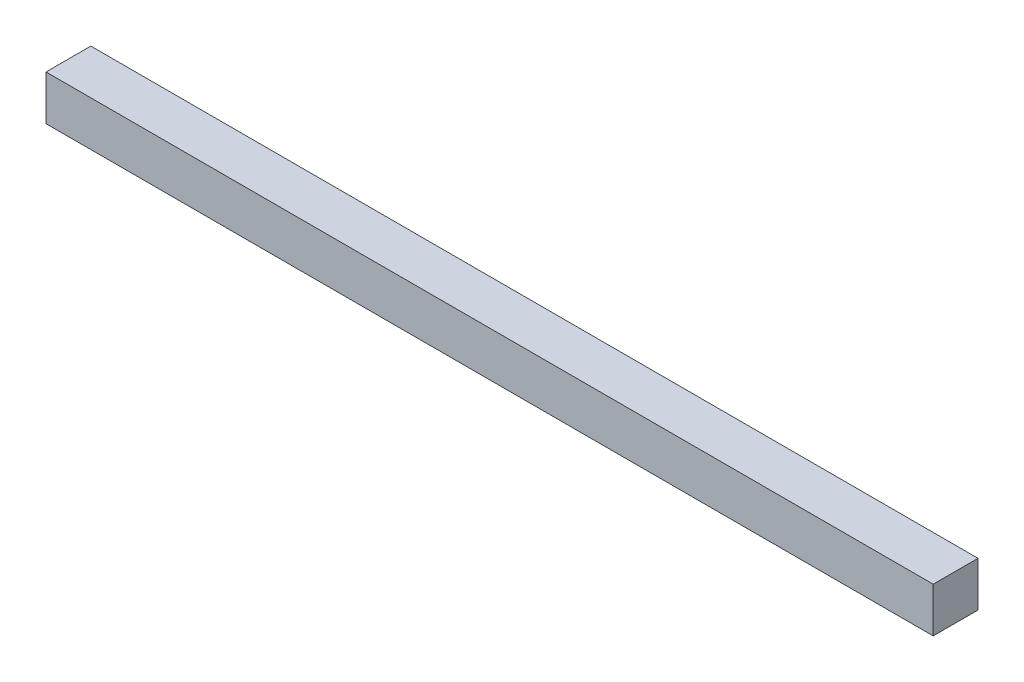
ISO-10303-21;
HEADER;
FILE_DESCRIPTION(('STEP AP214'),'2;1');
FILE_NAME('part.step','',(''),(''),'','','');
FILE_SCHEMA(('AUTOMOTIVE_DESIGN { 1 0 10303 214 1 1 1 1 }'));
ENDSEC;
DATA;
#1=APPLICATION_CONTEXT('core data for automotive mechanical design processes');
#2=APPLICATION_PROTOCOL_DEFINITION('international standard','automotive_design',2000,#1);
#3=PRODUCT_CONTEXT('',#1,'mechanical');
#4=PRODUCT('Part','Part','',(#3));
#5=PRODUCT_RELATED_PRODUCT_CATEGORY('part','',(#4));
#6=PRODUCT_DEFINITION_FORMATION('','',#4);
#7=PRODUCT_DEFINITION_CONTEXT('part definition',#1,'design');
#8=PRODUCT_DEFINITION('design','',#6,#7);
#9=PRODUCT_DEFINITION_SHAPE('','',#8);
#10=(LENGTH_UNIT() NAMED_UNIT(*) SI_UNIT(.MILLI.,.METRE.));
#11=(NAMED_UNIT(*) PLANE_ANGLE_UNIT() SI_UNIT($,.RADIAN.));
#12=(NAMED_UNIT(*) SI_UNIT($,.STERADIAN.) SOLID_ANGLE_UNIT());
#13=UNCERTAINTY_MEASURE_WITH_UNIT(LENGTH_MEASURE(1.E-05),#10,'distance_accuracy_value','');
#14=(GEOMETRIC_REPRESENTATION_CONTEXT(3) GLOBAL_UNCERTAINTY_ASSIGNED_CONTEXT((#13)) GLOBAL_UNIT_ASSIGNED_CONTEXT((#10,
#11,#12)) REPRESENTATION_CONTEXT('',''));
#15=CARTESIAN_POINT('',(0.,0.,0.));
#16=DIRECTION('',(0.,0.,1.));
#17=DIRECTION('',(1.,0.,0.));
#18=AXIS2_PLACEMENT_3D('',#15,#16,#17);
#19=CARTESIAN_POINT('',(49.5,-2.5,5.));
#20=DIRECTION('',(-1.,0.,0.));
#21=DIRECTION('',(0.,0.,1.));
#22=AXIS2_PLACEMENT_3D('',#19,#20,#21);
#23=PLANE('',#22);
#24=DIRECTION('',(0.,1.,0.));
#25=VECTOR('',#24,1.);
#26=CARTESIAN_POINT('',(49.5,-2.5,0.));
#27=LINE('',#26,#25);
#28=CARTESIAN_POINT('',(49.5,-2.5,0.));
#29=VERTEX_POINT('',#28);
#30=CARTESIAN_POINT('',(49.5,2.5,0.));
#31=VERTEX_POINT('',#30);
#32=EDGE_CURVE('E95',#29,#31,#27,.T.);
#33=ORIENTED_EDGE('',*,*,#32,.T.);
#34=DIRECTION('',(0.,0.,-1.));
#35=VECTOR('',#34,1.);
#36=CARTESIAN_POINT('',(49.5,2.5,5.));
#37=LINE('',#36,#35);
#38=CARTESIAN_POINT('',(49.5,2.5,5.));
#39=VERTEX_POINT('',#38);
#40=EDGE_CURVE('E11',#39,#31,#37,.T.);
#41=ORIENTED_EDGE('',*,*,#40,.F.);
#42=DIRECTION('',(0.,1.,0.));
#43=VECTOR('',#42,1.);
#44=CARTESIAN_POINT('',(49.5,-2.5,5.));
#45=LINE('',#44,#43);
#46=CARTESIAN_POINT('',(49.5,-2.5,5.));
#47=VERTEX_POINT('',#46);
#48=EDGE_CURVE('E83',#47,#39,#45,.T.);
#49=ORIENTED_EDGE('',*,*,#48,.F.);
#50=DIRECTION('',(0.,0.,-1.));
#51=VECTOR('',#50,1.);
#52=CARTESIAN_POINT('',(49.5,-2.5,5.));
#53=LINE('',#52,#51);
#54=EDGE_CURVE('E91',#47,#29,#53,.T.);
#55=ORIENTED_EDGE('',*,*,#54,.T.);
#56=EDGE_LOOP('',(#33,#41,#49,#55));
#57=FACE_BOUND('',#56,.T.);
#58=ADVANCED_FACE('F32',(#57),#23,.F.);
#59=CARTESIAN_POINT('',(-49.5,2.5,5.));
#60=DIRECTION('',(0.,-1.,0.));
#61=DIRECTION('',(0.,0.,-1.));
#62=AXIS2_PLACEMENT_3D('',#59,#60,#61);
#63=PLANE('',#62);
#64=DIRECTION('',(-1.,0.,0.));
#65=VECTOR('',#64,1.);
#66=CARTESIAN_POINT('',(-49.5,2.5,0.));
#67=LINE('',#66,#65);
#68=CARTESIAN_POINT('',(-49.5,2.5,0.));
#69=VERTEX_POINT('',#68);
#70=EDGE_CURVE('E87',#31,#69,#67,.T.);
#71=ORIENTED_EDGE('',*,*,#70,.T.);
#72=DIRECTION('',(0.,0.,-1.));
#73=VECTOR('',#72,1.);
#74=CARTESIAN_POINT('',(-49.5,2.5,5.));
#75=LINE('',#74,#73);
#76=CARTESIAN_POINT('',(-49.5,2.5,5.));
#77=VERTEX_POINT('',#76);
#78=EDGE_CURVE('E40',#77,#69,#75,.T.);
#79=ORIENTED_EDGE('',*,*,#78,.F.);
#80=DIRECTION('',(-1.,0.,0.));
#81=VECTOR('',#80,1.);
#82=CARTESIAN_POINT('',(-49.5,2.5,5.));
#83=LINE('',#82,#81);
#84=EDGE_CURVE('E78',#39,#77,#83,.T.);
#85=ORIENTED_EDGE('',*,*,#84,.F.);
#86=ORIENTED_EDGE('',*,*,#40,.T.);
#87=EDGE_LOOP('',(#71,#79,#85,#86));
#88=FACE_BOUND('',#87,.T.);
#89=ADVANCED_FACE('F86',(#88),#63,.F.);
#90=CARTESIAN_POINT('',(-49.5,-2.5,5.));
#91=DIRECTION('',(1.,0.,0.));
#92=DIRECTION('',(0.,0.,-1.));
#93=AXIS2_PLACEMENT_3D('',#90,#91,#92);
#94=PLANE('',#93);
#95=DIRECTION('',(0.,-1.,0.));
#96=VECTOR('',#95,1.);
#97=CARTESIAN_POINT('',(-49.5,-2.5,0.));
#98=LINE('',#97,#96);
#99=CARTESIAN_POINT('',(-49.5,-2.5,0.));
#100=VERTEX_POINT('',#99);
#101=EDGE_CURVE('E65',#69,#100,#98,.T.);
#102=ORIENTED_EDGE('',*,*,#101,.T.);
#103=DIRECTION('',(0.,0.,-1.));
#104=VECTOR('',#103,1.);
#105=CARTESIAN_POINT('',(-49.5,-2.5,5.));
#106=LINE('',#105,#104);
#107=CARTESIAN_POINT('',(-49.5,-2.5,5.));
#108=VERTEX_POINT('',#107);
#109=EDGE_CURVE('E88',#108,#100,#106,.T.);
#110=ORIENTED_EDGE('',*,*,#109,.F.);
#111=DIRECTION('',(0.,-1.,0.));
#112=VECTOR('',#111,1.);
#113=CARTESIAN_POINT('',(-49.5,-2.5,5.));
#114=LINE('',#113,#112);
#115=EDGE_CURVE('E81',#77,#108,#114,.T.);
#116=ORIENTED_EDGE('',*,*,#115,.F.);
#117=ORIENTED_EDGE('',*,*,#78,.T.);
#118=EDGE_LOOP('',(#102,#110,#116,#117));
#119=FACE_BOUND('',#118,.T.);
#120=ADVANCED_FACE('F89',(#119),#94,.F.);
#121=CARTESIAN_POINT('',(-49.5,-2.5,5.));
#122=DIRECTION('',(0.,1.,0.));
#123=DIRECTION('',(0.,0.,1.));
#124=AXIS2_PLACEMENT_3D('',#121,#122,#123);
#125=PLANE('',#124);
#126=DIRECTION('',(1.,0.,0.));
#127=VECTOR('',#126,1.);
#128=CARTESIAN_POINT('',(-49.5,-2.5,0.));
#129=LINE('',#128,#127);
#130=EDGE_CURVE('E71',#100,#29,#129,.T.);
#131=ORIENTED_EDGE('',*,*,#130,.T.);
#132=ORIENTED_EDGE('',*,*,#54,.F.);
#133=DIRECTION('',(1.,0.,0.));
#134=VECTOR('',#133,1.);
#135=CARTESIAN_POINT('',(-49.5,-2.5,5.));
#136=LINE('',#135,#134);
#137=EDGE_CURVE('E48',#108,#47,#136,.T.);
#138=ORIENTED_EDGE('',*,*,#137,.F.);
#139=ORIENTED_EDGE('',*,*,#109,.T.);
#140=EDGE_LOOP('',(#131,#132,#138,#139));
#141=FACE_BOUND('',#140,.T.);
#142=ADVANCED_FACE('F102',(#141),#125,.F.);
#143=CARTESIAN_POINT('',(0.,0.,5.));
#144=DIRECTION('',(0.,0.,-1.));
#145=DIRECTION('',(-1.,0.,0.));
#146=AXIS2_PLACEMENT_3D('',#143,#144,#145);
#147=PLANE('',#146);
#148=ORIENTED_EDGE('',*,*,#48,.T.);
#149=ORIENTED_EDGE('',*,*,#84,.T.);
#150=ORIENTED_EDGE('',*,*,#115,.T.);
#151=ORIENTED_EDGE('',*,*,#137,.T.);
#152=EDGE_LOOP('',(#148,#149,#150,#151));
#153=FACE_BOUND('',#152,.T.);
#154=ADVANCED_FACE('F79',(#153),#147,.F.);
#155=CARTESIAN_POINT('',(0.,0.,0.));
#156=DIRECTION('',(0.,0.,-1.));
#157=DIRECTION('',(-1.,0.,0.));
#158=AXIS2_PLACEMENT_3D('',#155,#156,#157);
#159=PLANE('',#158);
#160=ORIENTED_EDGE('',*,*,#32,.F.);
#161=ORIENTED_EDGE('',*,*,#130,.F.);
#162=ORIENTED_EDGE('',*,*,#101,.F.);
#163=ORIENTED_EDGE('',*,*,#70,.F.);
#164=EDGE_LOOP('',(#160,#161,#162,#163));
#165=FACE_BOUND('',#164,.T.);
#166=ADVANCED_FACE('F105',(#165),#159,.T.);
#167=CLOSED_SHELL('',(#58,#89,#120,#142,#154,#166));
#168=MANIFOLD_SOLID_BREP('B2',#167);
#169=ADVANCED_BREP_SHAPE_REPRESENTATION('',(#18,#168),#14);
#170=SHAPE_DEFINITION_REPRESENTATION(#9,#169);
ENDSEC;
END-ISO-10303-21;
